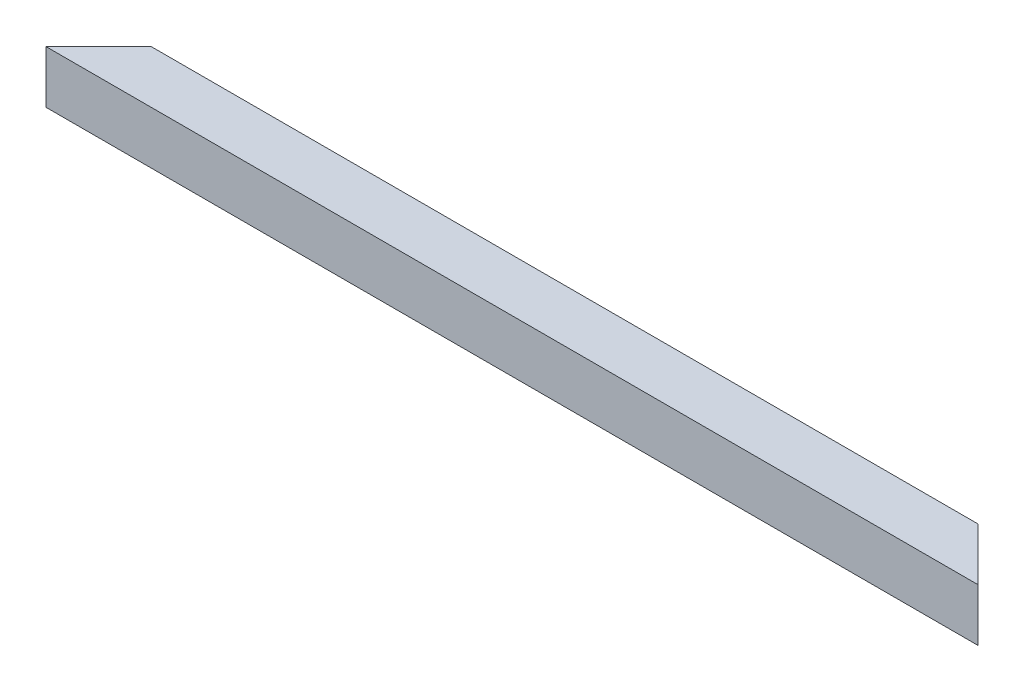
ISO-10303-21;
HEADER;
FILE_DESCRIPTION(('STEP AP214'),'2;1');
FILE_NAME('part.step','',(''),(''),'','','');
FILE_SCHEMA(('AUTOMOTIVE_DESIGN { 1 0 10303 214 1 1 1 1 }'));
ENDSEC;
DATA;
#1=APPLICATION_CONTEXT('core data for automotive mechanical design processes');
#2=APPLICATION_PROTOCOL_DEFINITION('international standard','automotive_design',2000,#1);
#3=PRODUCT_CONTEXT('',#1,'mechanical');
#4=PRODUCT('Part','Part','',(#3));
#5=PRODUCT_RELATED_PRODUCT_CATEGORY('part','',(#4));
#6=PRODUCT_DEFINITION_FORMATION('','',#4);
#7=PRODUCT_DEFINITION_CONTEXT('part definition',#1,'design');
#8=PRODUCT_DEFINITION('design','',#6,#7);
#9=PRODUCT_DEFINITION_SHAPE('','',#8);
#10=(LENGTH_UNIT() NAMED_UNIT(*) SI_UNIT(.MILLI.,.METRE.));
#11=(NAMED_UNIT(*) PLANE_ANGLE_UNIT() SI_UNIT($,.RADIAN.));
#12=(NAMED_UNIT(*) SI_UNIT($,.STERADIAN.) SOLID_ANGLE_UNIT());
#13=UNCERTAINTY_MEASURE_WITH_UNIT(LENGTH_MEASURE(1.E-05),#10,'distance_accuracy_value','');
#14=(GEOMETRIC_REPRESENTATION_CONTEXT(3) GLOBAL_UNCERTAINTY_ASSIGNED_CONTEXT((#13)) GLOBAL_UNIT_ASSIGNED_CONTEXT((#10,
#11,#12)) REPRESENTATION_CONTEXT('',''));
#15=CARTESIAN_POINT('',(0.,0.,0.));
#16=DIRECTION('',(0.,0.,1.));
#17=DIRECTION('',(1.,0.,0.));
#18=AXIS2_PLACEMENT_3D('',#15,#16,#17);
#19=CARTESIAN_POINT('',(0.,1.2,-1.2));
#20=DIRECTION('',(0.,-1.,0.));
#21=DIRECTION('',(0.,0.,-1.));
#22=AXIS2_PLACEMENT_3D('',#19,#20,#21);
#23=PLANE('',#22);
#24=DIRECTION('',(1.,0.,0.));
#25=VECTOR('',#24,1.);
#26=CARTESIAN_POINT('',(0.,1.2,-24.2));
#27=LINE('',#26,#25);
#28=CARTESIAN_POINT('',(24.1999999999999,1.2,-24.2));
#29=VERTEX_POINT('',#28);
#30=CARTESIAN_POINT('',(425.8,1.2,-24.2));
#31=VERTEX_POINT('',#30);
#32=EDGE_CURVE('E150',#29,#31,#27,.T.);
#33=ORIENTED_EDGE('',*,*,#32,.F.);
#34=DIRECTION('',(-0.707106781186546,0.,0.707106781186549));
#35=VECTOR('',#34,1.);
#36=CARTESIAN_POINT('',(0.600000000000001,1.2,-0.600000000000003));
#37=LINE('',#36,#35);
#38=CARTESIAN_POINT('',(1.2,1.2,-1.2));
#39=VERTEX_POINT('',#38);
#40=EDGE_CURVE('E11',#29,#39,#37,.T.);
#41=ORIENTED_EDGE('',*,*,#40,.T.);
#42=DIRECTION('',(1.,0.,0.));
#43=VECTOR('',#42,1.);
#44=CARTESIAN_POINT('',(0.,1.2,-1.2));
#45=LINE('',#44,#43);
#46=CARTESIAN_POINT('',(448.8,1.2,-1.20000000000003));
#47=VERTEX_POINT('',#46);
#48=EDGE_CURVE('E146',#39,#47,#45,.T.);
#49=ORIENTED_EDGE('',*,*,#48,.T.);
#50=DIRECTION('',(-0.707106781186551,0.,-0.707106781186544));
#51=VECTOR('',#50,1.);
#52=CARTESIAN_POINT('',(224.399999999998,1.2,-225.6));
#53=LINE('',#52,#51);
#54=EDGE_CURVE('E51',#47,#31,#53,.T.);
#55=ORIENTED_EDGE('',*,*,#54,.T.);
#56=EDGE_LOOP('',(#33,#41,#49,#55));
#57=FACE_BOUND('',#56,.T.);
#58=ADVANCED_FACE('F42',(#57),#23,.F.);
#59=CARTESIAN_POINT('',(0.,24.2,-24.2));
#60=DIRECTION('',(0.,0.,-1.));
#61=DIRECTION('',(0.,1.,0.));
#62=AXIS2_PLACEMENT_3D('',#59,#60,#61);
#63=PLANE('',#62);
#64=DIRECTION('',(1.,0.,0.));
#65=VECTOR('',#64,1.);
#66=CARTESIAN_POINT('',(0.,24.2,-24.2));
#67=LINE('',#66,#65);
#68=CARTESIAN_POINT('',(24.1999999999999,24.2,-24.2));
#69=VERTEX_POINT('',#68);
#70=CARTESIAN_POINT('',(425.8,24.2,-24.2));
#71=VERTEX_POINT('',#70);
#72=EDGE_CURVE('E154',#69,#71,#67,.T.);
#73=ORIENTED_EDGE('',*,*,#72,.F.);
#74=DIRECTION('',(0.,-1.,0.));
#75=VECTOR('',#74,1.);
#76=CARTESIAN_POINT('',(24.1999999999999,24.2,-24.2));
#77=LINE('',#76,#75);
#78=EDGE_CURVE('E167',#69,#29,#77,.T.);
#79=ORIENTED_EDGE('',*,*,#78,.T.);
#80=ORIENTED_EDGE('',*,*,#32,.T.);
#81=DIRECTION('',(0.,1.,0.));
#82=VECTOR('',#81,1.);
#83=CARTESIAN_POINT('',(425.8,24.1999999999999,-24.2));
#84=LINE('',#83,#82);
#85=EDGE_CURVE('E179',#31,#71,#84,.T.);
#86=ORIENTED_EDGE('',*,*,#85,.T.);
#87=EDGE_LOOP('',(#73,#79,#80,#86));
#88=FACE_BOUND('',#87,.T.);
#89=ADVANCED_FACE('F211',(#88),#63,.F.);
#90=CARTESIAN_POINT('',(0.,24.2,-1.2));
#91=DIRECTION('',(0.,1.,0.));
#92=DIRECTION('',(0.,0.,1.));
#93=AXIS2_PLACEMENT_3D('',#90,#91,#92);
#94=PLANE('',#93);
#95=DIRECTION('',(1.,0.,0.));
#96=VECTOR('',#95,1.);
#97=CARTESIAN_POINT('',(0.,24.2,-1.2));
#98=LINE('',#97,#96);
#99=CARTESIAN_POINT('',(1.2,24.2,-1.2));
#100=VERTEX_POINT('',#99);
#101=CARTESIAN_POINT('',(448.8,24.2,-1.20000000000003));
#102=VERTEX_POINT('',#101);
#103=EDGE_CURVE('E125',#100,#102,#98,.T.);
#104=ORIENTED_EDGE('',*,*,#103,.F.);
#105=DIRECTION('',(0.707106781186546,0.,-0.707106781186549));
#106=VECTOR('',#105,1.);
#107=CARTESIAN_POINT('',(0.6,24.2,-0.600000000000002));
#108=LINE('',#107,#106);
#109=EDGE_CURVE('E163',#100,#69,#108,.T.);
#110=ORIENTED_EDGE('',*,*,#109,.T.);
#111=ORIENTED_EDGE('',*,*,#72,.T.);
#112=DIRECTION('',(0.707106781186551,0.,0.707106781186544));
#113=VECTOR('',#112,1.);
#114=CARTESIAN_POINT('',(224.399999999998,24.2,-225.6));
#115=LINE('',#114,#113);
#116=EDGE_CURVE('E175',#71,#102,#115,.T.);
#117=ORIENTED_EDGE('',*,*,#116,.T.);
#118=EDGE_LOOP('',(#104,#110,#111,#117));
#119=FACE_BOUND('',#118,.T.);
#120=ADVANCED_FACE('F213',(#119),#94,.F.);
#121=CARTESIAN_POINT('',(0.,24.2,-1.2));
#122=DIRECTION('',(0.,0.,1.));
#123=DIRECTION('',(0.,-1.,0.));
#124=AXIS2_PLACEMENT_3D('',#121,#122,#123);
#125=PLANE('',#124);
#126=ORIENTED_EDGE('',*,*,#48,.F.);
#127=DIRECTION('',(0.,1.,0.));
#128=VECTOR('',#127,1.);
#129=CARTESIAN_POINT('',(1.2,24.2,-1.2));
#130=LINE('',#129,#128);
#131=EDGE_CURVE('E66',#39,#100,#130,.T.);
#132=ORIENTED_EDGE('',*,*,#131,.T.);
#133=ORIENTED_EDGE('',*,*,#103,.T.);
#134=DIRECTION('',(0.,-1.,0.));
#135=VECTOR('',#134,1.);
#136=CARTESIAN_POINT('',(448.8,24.1999999999999,-1.2));
#137=LINE('',#136,#135);
#138=EDGE_CURVE('E171',#102,#47,#137,.T.);
#139=ORIENTED_EDGE('',*,*,#138,.T.);
#140=EDGE_LOOP('',(#126,#132,#133,#139));
#141=FACE_BOUND('',#140,.T.);
#142=ADVANCED_FACE('F205',(#141),#125,.F.);
#143=CARTESIAN_POINT('',(450.,0.,0.));
#144=DIRECTION('',(-0.707106781186544,0.,0.707106781186551));
#145=DIRECTION('',(0.707106781186551,0.,0.707106781186544));
#146=AXIS2_PLACEMENT_3D('',#143,#144,#145);
#147=PLANE('',#146);
#148=DIRECTION('',(0.707106781186551,0.,0.707106781186544));
#149=VECTOR('',#148,1.);
#150=CARTESIAN_POINT('',(450.,25.4,0.));
#151=LINE('',#150,#149);
#152=CARTESIAN_POINT('',(424.6,25.4,-25.4));
#153=VERTEX_POINT('',#152);
#154=CARTESIAN_POINT('',(450.,25.4,0.));
#155=VERTEX_POINT('',#154);
#156=EDGE_CURVE('E185',#153,#155,#151,.T.);
#157=ORIENTED_EDGE('',*,*,#156,.T.);
#158=DIRECTION('',(0.,-1.,0.));
#159=VECTOR('',#158,1.);
#160=CARTESIAN_POINT('',(450.,25.4,0.));
#161=LINE('',#160,#159);
#162=CARTESIAN_POINT('',(450.,0.,0.));
#163=VERTEX_POINT('',#162);
#164=EDGE_CURVE('E131',#155,#163,#161,.T.);
#165=ORIENTED_EDGE('',*,*,#164,.T.);
#166=DIRECTION('',(0.707106781186551,0.,0.707106781186544));
#167=VECTOR('',#166,1.);
#168=CARTESIAN_POINT('',(450.,0.,0.));
#169=LINE('',#168,#167);
#170=CARTESIAN_POINT('',(424.6,0.,-25.4));
#171=VERTEX_POINT('',#170);
#172=EDGE_CURVE('E120',#171,#163,#169,.T.);
#173=ORIENTED_EDGE('',*,*,#172,.F.);
#174=DIRECTION('',(0.,1.,0.));
#175=VECTOR('',#174,1.);
#176=CARTESIAN_POINT('',(424.6,0.,-25.4));
#177=LINE('',#176,#175);
#178=EDGE_CURVE('E186',#171,#153,#177,.T.);
#179=ORIENTED_EDGE('',*,*,#178,.T.);
#180=EDGE_LOOP('',(#157,#165,#173,#179));
#181=FACE_BOUND('',#180,.T.);
#182=ORIENTED_EDGE('',*,*,#116,.F.);
#183=ORIENTED_EDGE('',*,*,#85,.F.);
#184=ORIENTED_EDGE('',*,*,#54,.F.);
#185=ORIENTED_EDGE('',*,*,#138,.F.);
#186=EDGE_LOOP('',(#182,#183,#184,#185));
#187=FACE_BOUND('',#186,.T.);
#188=ADVANCED_FACE('F202',(#181,#187),#147,.F.);
#189=CARTESIAN_POINT('',(0.,0.,0.));
#190=DIRECTION('',(0.707106781186549,0.,0.707106781186546));
#191=DIRECTION('',(0.707106781186546,0.,-0.707106781186549));
#192=AXIS2_PLACEMENT_3D('',#189,#190,#191);
#193=PLANE('',#192);
#194=DIRECTION('',(0.707106781186546,0.,-0.707106781186549));
#195=VECTOR('',#194,1.);
#196=CARTESIAN_POINT('',(0.,25.4,0.));
#197=LINE('',#196,#195);
#198=CARTESIAN_POINT('',(0.,25.4,0.));
#199=VERTEX_POINT('',#198);
#200=CARTESIAN_POINT('',(25.3999999999999,25.4,-25.4));
#201=VERTEX_POINT('',#200);
#202=EDGE_CURVE('E114',#199,#201,#197,.T.);
#203=ORIENTED_EDGE('',*,*,#202,.T.);
#204=DIRECTION('',(0.,1.,0.));
#205=VECTOR('',#204,1.);
#206=CARTESIAN_POINT('',(25.3999999999999,0.,-25.4));
#207=LINE('',#206,#205);
#208=CARTESIAN_POINT('',(25.3999999999998,0.,-25.3999999999999));
#209=VERTEX_POINT('',#208);
#210=EDGE_CURVE('E58',#209,#201,#207,.T.);
#211=ORIENTED_EDGE('',*,*,#210,.F.);
#212=DIRECTION('',(0.707106781186546,0.,-0.707106781186549));
#213=VECTOR('',#212,1.);
#214=CARTESIAN_POINT('',(0.,0.,0.));
#215=LINE('',#214,#213);
#216=CARTESIAN_POINT('',(0.,0.,0.));
#217=VERTEX_POINT('',#216);
#218=EDGE_CURVE('E104',#217,#209,#215,.T.);
#219=ORIENTED_EDGE('',*,*,#218,.F.);
#220=DIRECTION('',(0.,-1.,0.));
#221=VECTOR('',#220,1.);
#222=CARTESIAN_POINT('',(0.,25.4,0.));
#223=LINE('',#222,#221);
#224=EDGE_CURVE('E108',#199,#217,#223,.T.);
#225=ORIENTED_EDGE('',*,*,#224,.F.);
#226=EDGE_LOOP('',(#203,#211,#219,#225));
#227=FACE_BOUND('',#226,.T.);
#228=ORIENTED_EDGE('',*,*,#40,.F.);
#229=ORIENTED_EDGE('',*,*,#78,.F.);
#230=ORIENTED_EDGE('',*,*,#109,.F.);
#231=ORIENTED_EDGE('',*,*,#131,.F.);
#232=EDGE_LOOP('',(#228,#229,#230,#231));
#233=FACE_BOUND('',#232,.T.);
#234=ADVANCED_FACE('F106',(#227,#233),#193,.F.);
#235=CARTESIAN_POINT('',(0.,25.4,0.));
#236=DIRECTION('',(0.,0.,-1.));
#237=DIRECTION('',(-1.,0.,0.));
#238=AXIS2_PLACEMENT_3D('',#235,#236,#237);
#239=PLANE('',#238);
#240=DIRECTION('',(1.,0.,0.));
#241=VECTOR('',#240,1.);
#242=CARTESIAN_POINT('',(0.,0.,0.));
#243=LINE('',#242,#241);
#244=EDGE_CURVE('E118',#217,#163,#243,.T.);
#245=ORIENTED_EDGE('',*,*,#244,.T.);
#246=ORIENTED_EDGE('',*,*,#164,.F.);
#247=DIRECTION('',(1.,0.,0.));
#248=VECTOR('',#247,1.);
#249=CARTESIAN_POINT('',(0.,25.4,0.));
#250=LINE('',#249,#248);
#251=EDGE_CURVE('E129',#199,#155,#250,.T.);
#252=ORIENTED_EDGE('',*,*,#251,.F.);
#253=ORIENTED_EDGE('',*,*,#224,.T.);
#254=EDGE_LOOP('',(#245,#246,#252,#253));
#255=FACE_BOUND('',#254,.T.);
#256=ADVANCED_FACE('F44',(#255),#239,.F.);
#257=CARTESIAN_POINT('',(450.,25.4,-25.4));
#258=DIRECTION('',(0.,0.,1.));
#259=DIRECTION('',(1.,0.,0.));
#260=AXIS2_PLACEMENT_3D('',#257,#258,#259);
#261=PLANE('',#260);
#262=DIRECTION('',(-1.,0.,0.));
#263=VECTOR('',#262,1.);
#264=CARTESIAN_POINT('',(450.,0.,-25.4));
#265=LINE('',#264,#263);
#266=EDGE_CURVE('E124',#171,#209,#265,.T.);
#267=ORIENTED_EDGE('',*,*,#266,.T.);
#268=ORIENTED_EDGE('',*,*,#210,.T.);
#269=DIRECTION('',(-1.,0.,0.));
#270=VECTOR('',#269,1.);
#271=CARTESIAN_POINT('',(450.,25.4,-25.4));
#272=LINE('',#271,#270);
#273=EDGE_CURVE('E136',#153,#201,#272,.T.);
#274=ORIENTED_EDGE('',*,*,#273,.F.);
#275=ORIENTED_EDGE('',*,*,#178,.F.);
#276=EDGE_LOOP('',(#267,#268,#274,#275));
#277=FACE_BOUND('',#276,.T.);
#278=ADVANCED_FACE('F197',(#277),#261,.F.);
#279=CARTESIAN_POINT('',(0.,25.4,0.));
#280=DIRECTION('',(0.,1.,0.));
#281=DIRECTION('',(0.,0.,1.));
#282=AXIS2_PLACEMENT_3D('',#279,#280,#281);
#283=PLANE('',#282);
#284=ORIENTED_EDGE('',*,*,#202,.F.);
#285=ORIENTED_EDGE('',*,*,#251,.T.);
#286=ORIENTED_EDGE('',*,*,#156,.F.);
#287=ORIENTED_EDGE('',*,*,#273,.T.);
#288=EDGE_LOOP('',(#284,#285,#286,#287));
#289=FACE_BOUND('',#288,.T.);
#290=ADVANCED_FACE('F200',(#289),#283,.T.);
#291=CARTESIAN_POINT('',(0.,0.,0.));
#292=DIRECTION('',(0.,1.,0.));
#293=DIRECTION('',(0.,0.,1.));
#294=AXIS2_PLACEMENT_3D('',#291,#292,#293);
#295=PLANE('',#294);
#296=ORIENTED_EDGE('',*,*,#244,.F.);
#297=ORIENTED_EDGE('',*,*,#218,.T.);
#298=ORIENTED_EDGE('',*,*,#266,.F.);
#299=ORIENTED_EDGE('',*,*,#172,.T.);
#300=EDGE_LOOP('',(#296,#297,#298,#299));
#301=FACE_BOUND('',#300,.T.);
#302=ADVANCED_FACE('F119',(#301),#295,.F.);
#303=CLOSED_SHELL('',(#58,#89,#120,#142,#188,#234,#256,#278,#290,#302));
#304=MANIFOLD_SOLID_BREP('B2',#303);
#305=ADVANCED_BREP_SHAPE_REPRESENTATION('',(#18,#304),#14);
#306=SHAPE_DEFINITION_REPRESENTATION(#9,#305);
ENDSEC;
END-ISO-10303-21;
